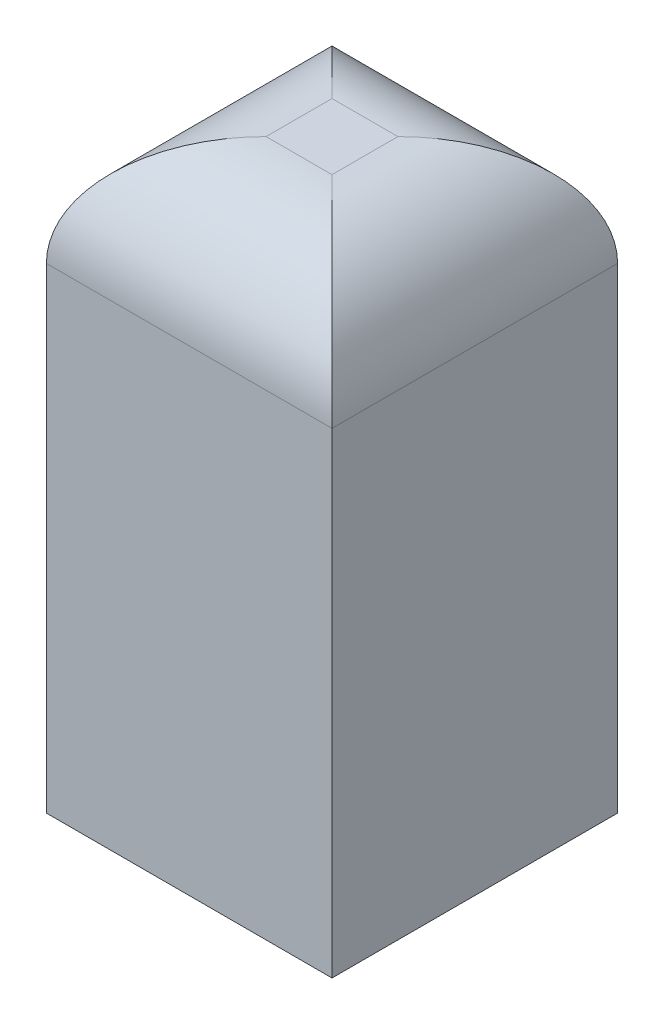
ISO-10303-21;
HEADER;
FILE_DESCRIPTION(('STEP AP214'),'2;1');
FILE_NAME('part.step','',(''),(''),'','','');
FILE_SCHEMA(('AUTOMOTIVE_DESIGN { 1 0 10303 214 1 1 1 1 }'));
ENDSEC;
DATA;
#1=APPLICATION_CONTEXT('core data for automotive mechanical design processes');
#2=APPLICATION_PROTOCOL_DEFINITION('international standard','automotive_design',2000,#1);
#3=PRODUCT_CONTEXT('',#1,'mechanical');
#4=PRODUCT('Part','Part','',(#3));
#5=PRODUCT_RELATED_PRODUCT_CATEGORY('part','',(#4));
#6=PRODUCT_DEFINITION_FORMATION('','',#4);
#7=PRODUCT_DEFINITION_CONTEXT('part definition',#1,'design');
#8=PRODUCT_DEFINITION('design','',#6,#7);
#9=PRODUCT_DEFINITION_SHAPE('','',#8);
#10=(LENGTH_UNIT() NAMED_UNIT(*) SI_UNIT(.MILLI.,.METRE.));
#11=(NAMED_UNIT(*) PLANE_ANGLE_UNIT() SI_UNIT($,.RADIAN.));
#12=(NAMED_UNIT(*) SI_UNIT($,.STERADIAN.) SOLID_ANGLE_UNIT());
#13=UNCERTAINTY_MEASURE_WITH_UNIT(LENGTH_MEASURE(1.E-05),#10,'distance_accuracy_value','');
#14=(GEOMETRIC_REPRESENTATION_CONTEXT(3) GLOBAL_UNCERTAINTY_ASSIGNED_CONTEXT((#13)) GLOBAL_UNIT_ASSIGNED_CONTEXT((#10,
#11,#12)) REPRESENTATION_CONTEXT('',''));
#15=CARTESIAN_POINT('',(0.,0.,0.));
#16=DIRECTION('',(0.,0.,1.));
#17=DIRECTION('',(1.,0.,0.));
#18=AXIS2_PLACEMENT_3D('',#15,#16,#17);
#19=CARTESIAN_POINT('',(1.95,8.,-1.95));
#20=DIRECTION('',(-1.,0.,0.));
#21=DIRECTION('',(0.,0.,1.));
#22=AXIS2_PLACEMENT_3D('',#19,#20,#21);
#23=PLANE('',#22);
#24=DIRECTION('',(0.,-1.,0.));
#25=VECTOR('',#24,1.);
#26=CARTESIAN_POINT('',(1.95,8.,-1.95));
#27=LINE('',#26,#25);
#28=CARTESIAN_POINT('',(1.95,6.5,-1.95));
#29=VERTEX_POINT('',#28);
#30=CARTESIAN_POINT('',(1.95,0.,-1.95));
#31=VERTEX_POINT('',#30);
#32=EDGE_CURVE('E85',#29,#31,#27,.T.);
#33=ORIENTED_EDGE('',*,*,#32,.F.);
#34=DIRECTION('',(0.,0.,-1.));
#35=VECTOR('',#34,1.);
#36=CARTESIAN_POINT('',(1.95,6.5,1.95));
#37=LINE('',#36,#35);
#38=CARTESIAN_POINT('',(1.95,6.5,1.95));
#39=VERTEX_POINT('',#38);
#40=EDGE_CURVE('E11',#29,#39,#37,.F.);
#41=ORIENTED_EDGE('',*,*,#40,.T.);
#42=DIRECTION('',(0.,-1.,0.));
#43=VECTOR('',#42,1.);
#44=CARTESIAN_POINT('',(1.95,8.,1.95));
#45=LINE('',#44,#43);
#46=CARTESIAN_POINT('',(1.95,0.,1.95));
#47=VERTEX_POINT('',#46);
#48=EDGE_CURVE('E105',#39,#47,#45,.T.);
#49=ORIENTED_EDGE('',*,*,#48,.T.);
#50=DIRECTION('',(0.,0.,-1.));
#51=VECTOR('',#50,1.);
#52=CARTESIAN_POINT('',(1.95,0.,-1.95));
#53=LINE('',#52,#51);
#54=EDGE_CURVE('E100',#47,#31,#53,.T.);
#55=ORIENTED_EDGE('',*,*,#54,.T.);
#56=EDGE_LOOP('',(#33,#41,#49,#55));
#57=FACE_BOUND('',#56,.T.);
#58=ADVANCED_FACE('F33',(#57),#23,.F.);
#59=CARTESIAN_POINT('',(-1.95,8.,-1.95));
#60=DIRECTION('',(0.,0.,1.));
#61=DIRECTION('',(1.,0.,0.));
#62=AXIS2_PLACEMENT_3D('',#59,#60,#61);
#63=PLANE('',#62);
#64=DIRECTION('',(0.,-1.,0.));
#65=VECTOR('',#64,1.);
#66=CARTESIAN_POINT('',(-1.95,8.,-1.95));
#67=LINE('',#66,#65);
#68=CARTESIAN_POINT('',(-1.95,6.5,-1.95));
#69=VERTEX_POINT('',#68);
#70=CARTESIAN_POINT('',(-1.95,0.,-1.95));
#71=VERTEX_POINT('',#70);
#72=EDGE_CURVE('E94',#69,#71,#67,.T.);
#73=ORIENTED_EDGE('',*,*,#72,.F.);
#74=DIRECTION('',(-1.,0.,0.));
#75=VECTOR('',#74,1.);
#76=CARTESIAN_POINT('',(1.95,6.5,-1.95));
#77=LINE('',#76,#75);
#78=EDGE_CURVE('E42',#69,#29,#77,.F.);
#79=ORIENTED_EDGE('',*,*,#78,.T.);
#80=ORIENTED_EDGE('',*,*,#32,.T.);
#81=DIRECTION('',(-1.,0.,0.));
#82=VECTOR('',#81,1.);
#83=CARTESIAN_POINT('',(-1.95,0.,-1.95));
#84=LINE('',#83,#82);
#85=EDGE_CURVE('E88',#31,#71,#84,.T.);
#86=ORIENTED_EDGE('',*,*,#85,.T.);
#87=EDGE_LOOP('',(#73,#79,#80,#86));
#88=FACE_BOUND('',#87,.T.);
#89=ADVANCED_FACE('F87',(#88),#63,.F.);
#90=CARTESIAN_POINT('',(-1.95,8.,-1.95));
#91=DIRECTION('',(1.,0.,0.));
#92=DIRECTION('',(0.,0.,-1.));
#93=AXIS2_PLACEMENT_3D('',#90,#91,#92);
#94=PLANE('',#93);
#95=DIRECTION('',(0.,-1.,0.));
#96=VECTOR('',#95,1.);
#97=CARTESIAN_POINT('',(-1.95,8.,1.95));
#98=LINE('',#97,#96);
#99=CARTESIAN_POINT('',(-1.95,6.5,1.95));
#100=VERTEX_POINT('',#99);
#101=CARTESIAN_POINT('',(-1.95,0.,1.95));
#102=VERTEX_POINT('',#101);
#103=EDGE_CURVE('E115',#100,#102,#98,.T.);
#104=ORIENTED_EDGE('',*,*,#103,.F.);
#105=DIRECTION('',(0.,0.,1.));
#106=VECTOR('',#105,1.);
#107=CARTESIAN_POINT('',(-1.95,6.5,-1.95));
#108=LINE('',#107,#106);
#109=EDGE_CURVE('E57',#100,#69,#108,.F.);
#110=ORIENTED_EDGE('',*,*,#109,.T.);
#111=ORIENTED_EDGE('',*,*,#72,.T.);
#112=DIRECTION('',(0.,0.,1.));
#113=VECTOR('',#112,1.);
#114=CARTESIAN_POINT('',(-1.95,0.,-1.95));
#115=LINE('',#114,#113);
#116=EDGE_CURVE('E102',#71,#102,#115,.T.);
#117=ORIENTED_EDGE('',*,*,#116,.T.);
#118=EDGE_LOOP('',(#104,#110,#111,#117));
#119=FACE_BOUND('',#118,.T.);
#120=ADVANCED_FACE('F153',(#119),#94,.F.);
#121=CARTESIAN_POINT('',(-1.95,8.,1.95));
#122=DIRECTION('',(0.,0.,-1.));
#123=DIRECTION('',(-1.,0.,0.));
#124=AXIS2_PLACEMENT_3D('',#121,#122,#123);
#125=PLANE('',#124);
#126=ORIENTED_EDGE('',*,*,#48,.F.);
#127=DIRECTION('',(1.,0.,0.));
#128=VECTOR('',#127,1.);
#129=CARTESIAN_POINT('',(-1.95,6.5,1.95));
#130=LINE('',#129,#128);
#131=EDGE_CURVE('E126',#39,#100,#130,.F.);
#132=ORIENTED_EDGE('',*,*,#131,.T.);
#133=ORIENTED_EDGE('',*,*,#103,.T.);
#134=DIRECTION('',(1.,0.,0.));
#135=VECTOR('',#134,1.);
#136=CARTESIAN_POINT('',(-1.95,0.,1.95));
#137=LINE('',#136,#135);
#138=EDGE_CURVE('E112',#102,#47,#137,.T.);
#139=ORIENTED_EDGE('',*,*,#138,.T.);
#140=EDGE_LOOP('',(#126,#132,#133,#139));
#141=FACE_BOUND('',#140,.T.);
#142=ADVANCED_FACE('F152',(#141),#125,.F.);
#143=CARTESIAN_POINT('',(0.,8.,0.));
#144=DIRECTION('',(0.,1.,0.));
#145=DIRECTION('',(0.,0.,1.));
#146=AXIS2_PLACEMENT_3D('',#143,#144,#145);
#147=PLANE('',#146);
#148=DIRECTION('',(0.,0.,1.));
#149=VECTOR('',#148,1.);
#150=CARTESIAN_POINT('',(-0.45,8.,1.95));
#151=LINE('',#150,#149);
#152=CARTESIAN_POINT('',(-0.45,8.,-0.45));
#153=VERTEX_POINT('',#152);
#154=CARTESIAN_POINT('',(-0.45,8.,0.45));
#155=VERTEX_POINT('',#154);
#156=EDGE_CURVE('E121',#153,#155,#151,.T.);
#157=ORIENTED_EDGE('',*,*,#156,.T.);
#158=DIRECTION('',(1.,0.,0.));
#159=VECTOR('',#158,1.);
#160=CARTESIAN_POINT('',(1.95,8.,0.45));
#161=LINE('',#160,#159);
#162=CARTESIAN_POINT('',(0.449999999999999,8.,0.45));
#163=VERTEX_POINT('',#162);
#164=EDGE_CURVE('E123',#155,#163,#161,.T.);
#165=ORIENTED_EDGE('',*,*,#164,.T.);
#166=DIRECTION('',(0.,0.,-1.));
#167=VECTOR('',#166,1.);
#168=CARTESIAN_POINT('',(0.449999999999999,8.,-1.95));
#169=LINE('',#168,#167);
#170=CARTESIAN_POINT('',(0.449999999999999,8.,-0.45));
#171=VERTEX_POINT('',#170);
#172=EDGE_CURVE('E93',#163,#171,#169,.T.);
#173=ORIENTED_EDGE('',*,*,#172,.T.);
#174=DIRECTION('',(-1.,0.,0.));
#175=VECTOR('',#174,1.);
#176=CARTESIAN_POINT('',(-1.95,8.,-0.45));
#177=LINE('',#176,#175);
#178=EDGE_CURVE('E119',#171,#153,#177,.T.);
#179=ORIENTED_EDGE('',*,*,#178,.T.);
#180=EDGE_LOOP('',(#157,#165,#173,#179));
#181=FACE_BOUND('',#180,.T.);
#182=ADVANCED_FACE('F145',(#181),#147,.T.);
#183=CARTESIAN_POINT('',(0.,0.,0.));
#184=DIRECTION('',(0.,1.,0.));
#185=DIRECTION('',(0.,0.,1.));
#186=AXIS2_PLACEMENT_3D('',#183,#184,#185);
#187=PLANE('',#186);
#188=ORIENTED_EDGE('',*,*,#54,.F.);
#189=ORIENTED_EDGE('',*,*,#138,.F.);
#190=ORIENTED_EDGE('',*,*,#116,.F.);
#191=ORIENTED_EDGE('',*,*,#85,.F.);
#192=EDGE_LOOP('',(#188,#189,#190,#191));
#193=FACE_BOUND('',#192,.T.);
#194=ADVANCED_FACE('F98',(#193),#187,.F.);
#195=CARTESIAN_POINT('',(0.,6.5,-0.45));
#196=DIRECTION('',(1.,0.,0.));
#197=DIRECTION('',(0.,0.,-1.));
#198=AXIS2_PLACEMENT_3D('',#195,#196,#197);
#199=CYLINDRICAL_SURFACE('',#198,1.5);
#200=CARTESIAN_POINT('',(0.449999999999999,6.5,-0.45));
#201=DIRECTION('',(0.707106781186548,0.,0.707106781186547));
#202=DIRECTION('',(-0.707106781186547,0.,0.707106781186548));
#203=AXIS2_PLACEMENT_3D('',#200,#201,#202);
#204=ELLIPSE('',#203,2.12132034355964,1.5);
#205=EDGE_CURVE('E109',#29,#171,#204,.T.);
#206=ORIENTED_EDGE('',*,*,#205,.F.);
#207=ORIENTED_EDGE('',*,*,#78,.F.);
#208=CARTESIAN_POINT('',(-0.45,6.5,-0.45));
#209=DIRECTION('',(0.707106781186547,0.,-0.707106781186548));
#210=DIRECTION('',(0.707106781186548,0.,0.707106781186547));
#211=AXIS2_PLACEMENT_3D('',#208,#209,#210);
#212=ELLIPSE('',#211,2.12132034355964,1.5);
#213=EDGE_CURVE('E37',#153,#69,#212,.F.);
#214=ORIENTED_EDGE('',*,*,#213,.F.);
#215=ORIENTED_EDGE('',*,*,#178,.F.);
#216=EDGE_LOOP('',(#206,#207,#214,#215));
#217=FACE_BOUND('',#216,.T.);
#218=ADVANCED_FACE('F35',(#217),#199,.T.);
#219=CARTESIAN_POINT('',(-0.45,6.5,0.));
#220=DIRECTION('',(0.,0.,-1.));
#221=DIRECTION('',(-1.,0.,0.));
#222=AXIS2_PLACEMENT_3D('',#219,#220,#221);
#223=CYLINDRICAL_SURFACE('',#222,1.5);
#224=ORIENTED_EDGE('',*,*,#213,.T.);
#225=ORIENTED_EDGE('',*,*,#109,.F.);
#226=CARTESIAN_POINT('',(-0.45,6.5,0.45));
#227=DIRECTION('',(-0.707106781186548,0.,-0.707106781186547));
#228=DIRECTION('',(0.707106781186547,0.,-0.707106781186548));
#229=AXIS2_PLACEMENT_3D('',#226,#227,#228);
#230=ELLIPSE('',#229,2.12132034355964,1.5);
#231=EDGE_CURVE('E133',#155,#100,#230,.F.);
#232=ORIENTED_EDGE('',*,*,#231,.F.);
#233=ORIENTED_EDGE('',*,*,#156,.F.);
#234=EDGE_LOOP('',(#224,#225,#232,#233));
#235=FACE_BOUND('',#234,.T.);
#236=ADVANCED_FACE('F170',(#235),#223,.T.);
#237=CARTESIAN_POINT('',(0.449999999999999,6.5,0.));
#238=DIRECTION('',(0.,0.,1.));
#239=DIRECTION('',(1.,0.,0.));
#240=AXIS2_PLACEMENT_3D('',#237,#238,#239);
#241=CYLINDRICAL_SURFACE('',#240,1.5);
#242=ORIENTED_EDGE('',*,*,#205,.T.);
#243=ORIENTED_EDGE('',*,*,#172,.F.);
#244=CARTESIAN_POINT('',(0.449999999999999,6.5,0.45));
#245=DIRECTION('',(-0.707106781186547,0.,0.707106781186548));
#246=DIRECTION('',(0.707106781186548,0.,0.707106781186547));
#247=AXIS2_PLACEMENT_3D('',#244,#245,#246);
#248=ELLIPSE('',#247,2.12132034355964,1.5);
#249=EDGE_CURVE('E131',#39,#163,#248,.T.);
#250=ORIENTED_EDGE('',*,*,#249,.F.);
#251=ORIENTED_EDGE('',*,*,#40,.F.);
#252=EDGE_LOOP('',(#242,#243,#250,#251));
#253=FACE_BOUND('',#252,.T.);
#254=ADVANCED_FACE('F138',(#253),#241,.T.);
#255=CARTESIAN_POINT('',(0.,6.5,0.45));
#256=DIRECTION('',(-1.,0.,0.));
#257=DIRECTION('',(0.,0.,1.));
#258=AXIS2_PLACEMENT_3D('',#255,#256,#257);
#259=CYLINDRICAL_SURFACE('',#258,1.5);
#260=ORIENTED_EDGE('',*,*,#231,.T.);
#261=ORIENTED_EDGE('',*,*,#131,.F.);
#262=ORIENTED_EDGE('',*,*,#249,.T.);
#263=ORIENTED_EDGE('',*,*,#164,.F.);
#264=EDGE_LOOP('',(#260,#261,#262,#263));
#265=FACE_BOUND('',#264,.T.);
#266=ADVANCED_FACE('F149',(#265),#259,.T.);
#267=CLOSED_SHELL('',(#58,#89,#120,#142,#182,#194,#218,#236,#254,#266));
#268=MANIFOLD_SOLID_BREP('B2',#267);
#269=ADVANCED_BREP_SHAPE_REPRESENTATION('',(#18,#268),#14);
#270=SHAPE_DEFINITION_REPRESENTATION(#9,#269);
ENDSEC;
END-ISO-10303-21;
